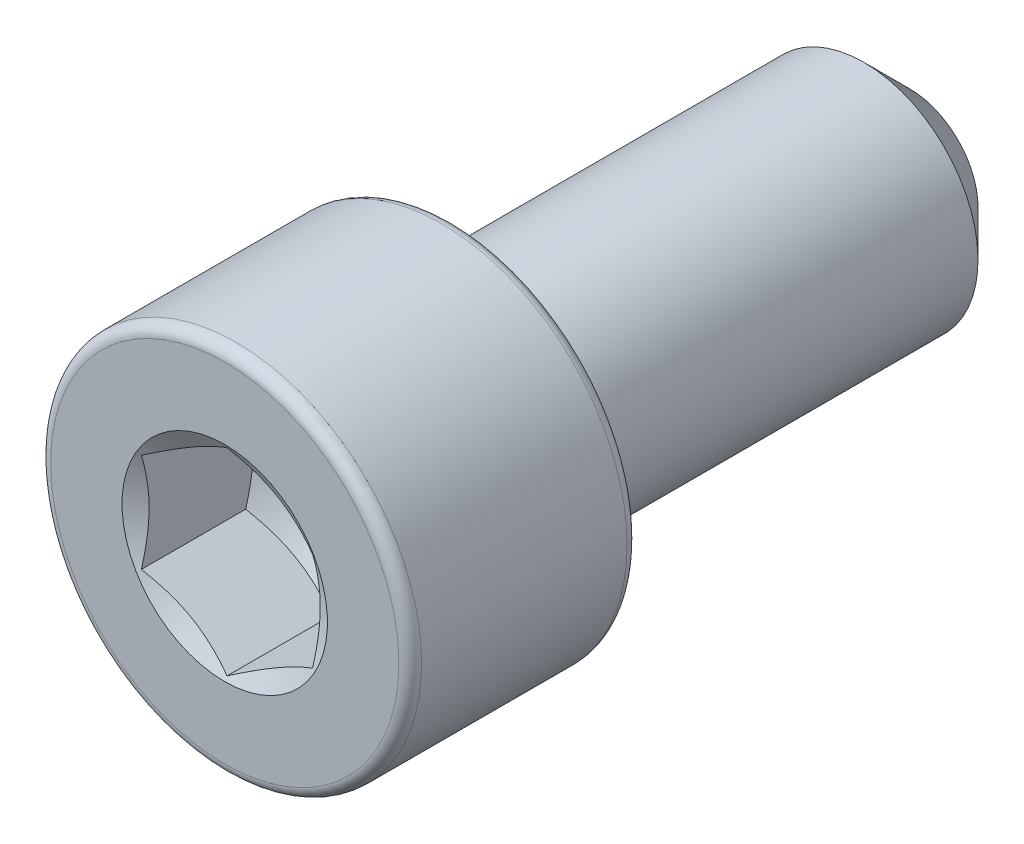
ISO-10303-21;
HEADER;
FILE_DESCRIPTION(('STEP AP214'),'2;1');
FILE_NAME('part.step','',(''),(''),'','','');
FILE_SCHEMA(('AUTOMOTIVE_DESIGN { 1 0 10303 214 1 1 1 1 }'));
ENDSEC;
DATA;
#1=APPLICATION_CONTEXT('core data for automotive mechanical design processes');
#2=APPLICATION_PROTOCOL_DEFINITION('international standard','automotive_design',2000,#1);
#3=PRODUCT_CONTEXT('',#1,'mechanical');
#4=PRODUCT('Part','Part','',(#3));
#5=PRODUCT_RELATED_PRODUCT_CATEGORY('part','',(#4));
#6=PRODUCT_DEFINITION_FORMATION('','',#4);
#7=PRODUCT_DEFINITION_CONTEXT('part definition',#1,'design');
#8=PRODUCT_DEFINITION('design','',#6,#7);
#9=PRODUCT_DEFINITION_SHAPE('','',#8);
#10=(LENGTH_UNIT() NAMED_UNIT(*) SI_UNIT(.MILLI.,.METRE.));
#11=(NAMED_UNIT(*) PLANE_ANGLE_UNIT() SI_UNIT($,.RADIAN.));
#12=(NAMED_UNIT(*) SI_UNIT($,.STERADIAN.) SOLID_ANGLE_UNIT());
#13=UNCERTAINTY_MEASURE_WITH_UNIT(LENGTH_MEASURE(1.E-05),#10,'distance_accuracy_value','');
#14=(GEOMETRIC_REPRESENTATION_CONTEXT(3) GLOBAL_UNCERTAINTY_ASSIGNED_CONTEXT((#13)) GLOBAL_UNIT_ASSIGNED_CONTEXT((#10,
#11,#12)) REPRESENTATION_CONTEXT('',''));
#15=CARTESIAN_POINT('',(0.,0.,0.));
#16=DIRECTION('',(0.,0.,1.));
#17=DIRECTION('',(1.,0.,0.));
#18=AXIS2_PLACEMENT_3D('',#15,#16,#17);
#19=CARTESIAN_POINT('',(0.,0.,8.00000000000001));
#20=DIRECTION('',(0.,0.,1.));
#21=DIRECTION('',(0.,-1.,0.));
#22=AXIS2_PLACEMENT_3D('',#19,#20,#21);
#23=CONICAL_SURFACE('',#22,3.6,1.0471975511966);
#24=CARTESIAN_POINT('',(-0.000200000000000054,-3.4642170851916,7.92160570091724));
#25=CARTESIAN_POINT('',(0.131635206588332,-3.38810199317916,7.87764354293854));
#26=CARTESIAN_POINT('',(0.264608405355249,-3.31132988107607,7.83766142477886));
#27=CARTESIAN_POINT('',(0.532857420002056,-3.15645624025988,7.7678719189317));
#28=CARTESIAN_POINT('',(0.668138002634342,-3.078351959461,7.73808922075161));
#29=CARTESIAN_POINT('',(0.937022602096484,-2.92311136358059,7.69172767769749));
#30=CARTESIAN_POINT('',(1.07058524542946,-2.84599893549862,7.67484027960918));
#31=CARTESIAN_POINT('',(1.33833905729569,-2.6914112001411,7.65467948093476));
#32=CARTESIAN_POINT('',(1.47252925247984,-2.61393645482892,7.65138938626732));
#33=CARTESIAN_POINT('',(1.72327559769581,-2.46916798492017,7.65823036937162));
#34=CARTESIAN_POINT('',(1.83986926497268,-2.40185259973207,7.66668175267885));
#35=CARTESIAN_POINT('',(2.07229698497464,-2.2676603930218,7.69346878149327));
#36=CARTESIAN_POINT('',(2.18813023365133,-2.20078403571721,7.71181357934795));
#37=CARTESIAN_POINT('',(2.42103725705637,-2.06631510305815,7.75767458933956));
#38=CARTESIAN_POINT('',(2.53808155051394,-1.99873954872331,7.78538522374932));
#39=CARTESIAN_POINT('',(2.77042435049913,-1.86459637060759,7.84827763362363));
#40=CARTESIAN_POINT('',(2.88572583417111,-1.79802702797161,7.88344462950779));
#41=CARTESIAN_POINT('',(3.00020000000001,-1.73193533751504,7.92160570091724));
#42=B_SPLINE_CURVE_WITH_KNOTS('',3,(#24,#25,#26,#27,#28,#29,#30,#31,#32,#33,#34,#35,#36,#37,#38,
#39,#40,#41),.UNSPECIFIED.,.F.,.F.,(4,2,2,2,2,2,2,2,4),(0.,0.47553983010304,0.952222784107965,
1.41710776961288,1.88142182298026,2.28572436316091,2.69040156475039,3.10405572063577,
3.51689749407071),.UNSPECIFIED.);
#43=CARTESIAN_POINT('',(0.,-3.46410161513776,7.92153903091736));
#44=VERTEX_POINT('',#43);
#45=CARTESIAN_POINT('',(3.00000000000001,-1.73205080756888,7.92153903091736));
#46=VERTEX_POINT('',#45);
#47=EDGE_CURVE('E187',#44,#46,#42,.T.);
#48=ORIENTED_EDGE('',*,*,#47,.F.);
#49=CARTESIAN_POINT('',(-3.00020000000001,-1.73193533751504,7.92160570091725));
#50=CARTESIAN_POINT('',(-2.86836479341167,-1.80805042952749,7.87764354293854));
#51=CARTESIAN_POINT('',(-2.73539159464476,-1.88482254163057,7.83766142477886));
#52=CARTESIAN_POINT('',(-2.46714257999795,-2.03969618244676,7.7678719189317));
#53=CARTESIAN_POINT('',(-2.33186199736566,-2.11780046324564,7.73808922075161));
#54=CARTESIAN_POINT('',(-2.06297739790352,-2.27304105912605,7.69172767769749));
#55=CARTESIAN_POINT('',(-1.92941475457054,-2.35015348720802,7.67484027960919));
#56=CARTESIAN_POINT('',(-1.66166094270431,-2.50474122256554,7.65467948093476));
#57=CARTESIAN_POINT('',(-1.52747074752016,-2.58221596787772,7.65138938626732));
#58=CARTESIAN_POINT('',(-1.2767244023042,-2.72698443778647,7.65823036937163));
#59=CARTESIAN_POINT('',(-1.16013073502733,-2.79429982297458,7.66668175267885));
#60=CARTESIAN_POINT('',(-0.927703015025365,-2.92849202968484,7.69346878149327));
#61=CARTESIAN_POINT('',(-0.811869766348671,-2.99536838698944,7.71181357934795));
#62=CARTESIAN_POINT('',(-0.578962742943634,-3.12983731964849,7.75767458933956));
#63=CARTESIAN_POINT('',(-0.46191844948606,-3.19741287398333,7.78538522374932));
#64=CARTESIAN_POINT('',(-0.229575649500876,-3.33155605209905,7.84827763362363));
#65=CARTESIAN_POINT('',(-0.114274165828894,-3.39812539473503,7.88344462950779));
#66=CARTESIAN_POINT('',(0.000200000000000271,-3.4642170851916,7.92160570091724));
#67=B_SPLINE_CURVE_WITH_KNOTS('',3,(#49,#50,#51,#52,#53,#54,#55,#56,#57,#58,#59,#60,#61,#62,#63,
#64,#65,#66),.UNSPECIFIED.,.F.,.F.,(4,2,2,2,2,2,2,2,4),(0.,0.475539830103041,0.952222784107965,
1.41710776961288,1.88142182298026,2.28572436316091,2.69040156475039,3.10405572063577,
3.51689749407071),.UNSPECIFIED.);
#68=CARTESIAN_POINT('',(-3.00000000000001,-1.73205080756888,7.92153903091736));
#69=VERTEX_POINT('',#68);
#70=EDGE_CURVE('E188',#69,#44,#67,.T.);
#71=ORIENTED_EDGE('',*,*,#70,.F.);
#72=CARTESIAN_POINT('',(-3.00000000000001,-4.60454559970548,9.0944367695661));
#73=CARTESIAN_POINT('',(-3.00000000000001,-4.47391054169675,9.03126141741228));
#74=CARTESIAN_POINT('',(-3.00000000000001,-4.34297039323752,8.96870586295172));
#75=CARTESIAN_POINT('',(-3.00000000000001,-4.08031748113025,8.84518394102797));
#76=CARTESIAN_POINT('',(-3.00000000000001,-3.9486045951669,8.78421783395116));
#77=CARTESIAN_POINT('',(-3.00000000000001,-3.68354182127473,8.66390732573261));
#78=CARTESIAN_POINT('',(-3.00000000000001,-3.55018689151928,8.6045739931804));
#79=CARTESIAN_POINT('',(-3.00000000000001,-3.28239942855972,8.48840044290758));
#80=CARTESIAN_POINT('',(-3.00000000000001,-3.14796694810594,8.43156010401619));
#81=CARTESIAN_POINT('',(-3.00000000000001,-2.87366017588524,8.31933431950721));
#82=CARTESIAN_POINT('',(-3.00000000000001,-2.7337454902095,8.26404705503255));
#83=CARTESIAN_POINT('',(-3.00000000000001,-2.45226155329319,8.15777424972904));
#84=CARTESIAN_POINT('',(-3.00000000000001,-2.31069211589045,8.10678919831371));
#85=CARTESIAN_POINT('',(-3.00000000000001,-2.02595438104427,8.01049455102487));
#86=CARTESIAN_POINT('',(-3.00000000000001,-1.88279015583218,7.96517303737745));
#87=CARTESIAN_POINT('',(-3.00000000000001,-1.59440901204616,7.88169131765542));
#88=CARTESIAN_POINT('',(-3.00000000000001,-1.44919277107188,7.84352880439202));
#89=CARTESIAN_POINT('',(-3.00000000000001,-1.15742209925239,7.77642805316512));
#90=CARTESIAN_POINT('',(-3.00000000000001,-1.01087896269673,7.74744162313536));
#91=CARTESIAN_POINT('',(-3.00000000000001,-0.716021747589001,7.70036416986872));
#92=CARTESIAN_POINT('',(-3.00000000000001,-0.567707822307367,7.68227221053488));
#93=CARTESIAN_POINT('',(-3.00000000000001,-0.271966241302082,7.65866464300572));
#94=CARTESIAN_POINT('',(-3.00000000000001,-0.124551501985846,7.65299118452597));
#95=CARTESIAN_POINT('',(-3.00000000000001,0.170232897863812,7.6542888917464));
#96=CARTESIAN_POINT('',(-3.00000000000001,0.317602557053719,7.66126040336274));
#97=CARTESIAN_POINT('',(-3.00000000000001,0.569242516646927,7.68347501207321));
#98=CARTESIAN_POINT('',(-3.00000000000001,0.673786797963101,7.69578273353053));
#99=CARTESIAN_POINT('',(-3.00000000000001,0.88207567807701,7.72596864139937));
#100=CARTESIAN_POINT('',(-3.00000000000001,0.985820159978721,7.74384762684388));
#101=CARTESIAN_POINT('',(-3.00000000000001,1.29572170880589,7.8049008124224));
#102=CARTESIAN_POINT('',(-3.00000000000001,1.50042326804649,7.85547892309648));
#103=CARTESIAN_POINT('',(-3.00000000000001,1.90998694990798,7.97218933249931));
#104=CARTESIAN_POINT('',(-3.00000000000001,2.11475617286394,8.0386353280896));
#105=CARTESIAN_POINT('',(-3.00000000000001,2.41907905139384,8.14606638180559));
#106=CARTESIAN_POINT('',(-3.00000000000001,2.52003642794114,8.18316556980637));
#107=CARTESIAN_POINT('',(-3.00000000000001,2.72112426532943,8.25954165870318));
#108=CARTESIAN_POINT('',(-3.00000000000001,2.82125473380418,8.29881853946956));
#109=CARTESIAN_POINT('',(-3.00000000000001,3.04857034792646,8.39037300203019));
#110=CARTESIAN_POINT('',(-3.00000000000001,3.17552349019277,8.44322475633564));
#111=CARTESIAN_POINT('',(-3.00000000000001,3.42842038548634,8.55129565093389));
#112=CARTESIAN_POINT('',(-3.00000000000001,3.55436409186889,8.60651489988548));
#113=CARTESIAN_POINT('',(-3.00000000000001,3.93096455738107,8.77502565888229));
#114=CARTESIAN_POINT('',(-3.00000000000001,4.18035071154589,8.89115373008911));
#115=CARTESIAN_POINT('',(-3.00000000000001,4.67692235862025,9.12852767157089));
#116=CARTESIAN_POINT('',(-3.00000000000001,4.92410570477776,9.24977798728436));
#117=CARTESIAN_POINT('',(-3.00000000000001,5.4167278388721,9.4957836463119));
#118=CARTESIAN_POINT('',(-3.00000000000001,5.66216656911421,9.62053910487207));
#119=CARTESIAN_POINT('',(-3.00000000000001,6.13267205317365,9.86274264739468));
#120=CARTESIAN_POINT('',(-3.00000000000001,6.35783595459021,9.98000263261621));
#121=CARTESIAN_POINT('',(-3.00000000000001,6.80731894508508,10.2161447958732));
#122=CARTESIAN_POINT('',(-3.00000000000001,7.031638009326,10.3350270211332));
#123=CARTESIAN_POINT('',(-3.00000000000001,7.47911775650083,10.5737746366084));
#124=CARTESIAN_POINT('',(-3.00000000000001,7.70227990205747,10.6936372894531));
#125=CARTESIAN_POINT('',(-3.00000000000001,8.14805831498889,10.934347884523));
#126=CARTESIAN_POINT('',(-3.00000000000001,8.37067460852668,11.0551957782749));
#127=CARTESIAN_POINT('',(-3.00000000000001,8.59308735784223,11.1764145555931));
#128=B_SPLINE_CURVE_WITH_KNOTS('',3,(#72,#73,#74,#75,#76,#77,#78,#79,#80,#81,#82,#83,#84,#85,
#86,#87,#88,#89,#90,#91,#92,#93,#94,#95,#96,#97,#98,#99,#100,#101,#102,#103,#104,#105,#106,#107,
#108,#109,#110,#111,#112,#113,#114,#115,#116,#117,#118,#119,#120,#121,#122,#123,#124,#125,#126,
#127),.UNSPECIFIED.,.F.,.F.,(4,2,2,2,2,2,2,2,2,2,2,2,2,2,2,2,2,2,2,2,2,2,2,2,2,2,2,4),(0.,
0.435332783124324,0.87073644080395,1.30859254309794,1.74642733996611,2.19769874753646,
2.64902142207256,3.09937778722197,3.54958876210589,3.99739445311383,4.44516166135399,
4.88720346801788,5.32925736737266,5.64490330832936,5.96059454021016,6.59234794965086,
7.23780982675471,7.56046455676359,7.88311630478916,8.29563090734188,8.70816446301553,
9.53336112987791,10.3592892953865,11.1852446485614,11.9468392934247,12.7084561563303,
13.4683979588476,14.2283025955724),.UNSPECIFIED.);
#129=CARTESIAN_POINT('',(-3.00000000000001,1.73205080756888,7.92153903091736));
#130=VERTEX_POINT('',#129);
#131=EDGE_CURVE('E249',#130,#69,#128,.F.);
#132=ORIENTED_EDGE('',*,*,#131,.F.);
#133=CARTESIAN_POINT('',(0.0002,3.4642170851916,7.92160570091725));
#134=CARTESIAN_POINT('',(-0.131635206588332,3.38810199317915,7.87764354293854));
#135=CARTESIAN_POINT('',(-0.26460840535525,3.31132988107607,7.83766142477886));
#136=CARTESIAN_POINT('',(-0.532857420002056,3.15645624025988,7.7678719189317));
#137=CARTESIAN_POINT('',(-0.668138002634342,3.078351959461,7.73808922075162));
#138=CARTESIAN_POINT('',(-0.937022602096484,2.92311136358059,7.69172767769749));
#139=CARTESIAN_POINT('',(-1.07058524542946,2.84599893549862,7.67484027960919));
#140=CARTESIAN_POINT('',(-1.33833905729569,2.6914112001411,7.65467948093476));
#141=CARTESIAN_POINT('',(-1.47252925247984,2.61393645482892,7.65138938626732));
#142=CARTESIAN_POINT('',(-1.72327559769581,2.46916798492017,7.65823036937163));
#143=CARTESIAN_POINT('',(-1.83986926497268,2.40185259973206,7.66668175267885));
#144=CARTESIAN_POINT('',(-2.07229698497464,2.2676603930218,7.69346878149327));
#145=CARTESIAN_POINT('',(-2.18813023365133,2.2007840357172,7.71181357934795));
#146=CARTESIAN_POINT('',(-2.42103725705637,2.06631510305815,7.75767458933956));
#147=CARTESIAN_POINT('',(-2.53808155051394,1.99873954872331,7.78538522374932));
#148=CARTESIAN_POINT('',(-2.77042435049913,1.86459637060759,7.84827763362363));
#149=CARTESIAN_POINT('',(-2.88572583417111,1.79802702797161,7.88344462950779));
#150=CARTESIAN_POINT('',(-3.00020000000001,1.73193533751504,7.92160570091725));
#151=B_SPLINE_CURVE_WITH_KNOTS('',3,(#133,#134,#135,#136,#137,#138,#139,#140,#141,#142,#143,
#144,#145,#146,#147,#148,#149,#150),.UNSPECIFIED.,.F.,.F.,(4,2,2,2,2,2,2,2,4),(0.,
0.475539830103041,0.952222784107965,1.41710776961288,1.88142182298026,2.28572436316091,
2.69040156475039,3.10405572063577,3.51689749407071),.UNSPECIFIED.);
#152=CARTESIAN_POINT('',(0.,3.46410161513776,7.92153903091736));
#153=VERTEX_POINT('',#152);
#154=EDGE_CURVE('E112',#153,#130,#151,.T.);
#155=ORIENTED_EDGE('',*,*,#154,.F.);
#156=CARTESIAN_POINT('',(3.00020000000001,1.73193533751504,7.92160570091725));
#157=CARTESIAN_POINT('',(2.86836479341167,1.80805042952749,7.87764354293854));
#158=CARTESIAN_POINT('',(2.73539159464476,1.88482254163057,7.83766142477886));
#159=CARTESIAN_POINT('',(2.46714257999795,2.03969618244676,7.7678719189317));
#160=CARTESIAN_POINT('',(2.33186199736566,2.11780046324564,7.73808922075162));
#161=CARTESIAN_POINT('',(2.06297739790352,2.27304105912605,7.69172767769749));
#162=CARTESIAN_POINT('',(1.92941475457054,2.35015348720802,7.67484027960919));
#163=CARTESIAN_POINT('',(1.66166094270431,2.50474122256554,7.65467948093476));
#164=CARTESIAN_POINT('',(1.52747074752016,2.58221596787772,7.65138938626732));
#165=CARTESIAN_POINT('',(1.2767244023042,2.72698443778647,7.65823036937163));
#166=CARTESIAN_POINT('',(1.16013073502733,2.79429982297457,7.66668175267885));
#167=CARTESIAN_POINT('',(0.927703015025365,2.92849202968484,7.69346878149327));
#168=CARTESIAN_POINT('',(0.81186976634867,2.99536838698944,7.71181357934795));
#169=CARTESIAN_POINT('',(0.578962742943633,3.12983731964849,7.75767458933956));
#170=CARTESIAN_POINT('',(0.46191844948606,3.19741287398333,7.78538522374932));
#171=CARTESIAN_POINT('',(0.229575649500876,3.33155605209905,7.84827763362363));
#172=CARTESIAN_POINT('',(0.114274165828894,3.39812539473503,7.88344462950779));
#173=CARTESIAN_POINT('',(-0.000199999999999515,3.4642170851916,7.92160570091725));
#174=B_SPLINE_CURVE_WITH_KNOTS('',3,(#156,#157,#158,#159,#160,#161,#162,#163,#164,#165,#166,
#167,#168,#169,#170,#171,#172,#173),.UNSPECIFIED.,.F.,.F.,(4,2,2,2,2,2,2,2,4),(0.,
0.475539830103041,0.952222784107965,1.41710776961288,1.88142182298026,2.28572436316091,
2.69040156475039,3.10405572063577,3.51689749407071),.UNSPECIFIED.);
#175=CARTESIAN_POINT('',(3.00000000000001,1.73205080756888,7.92153903091736));
#176=VERTEX_POINT('',#175);
#177=EDGE_CURVE('E52',#176,#153,#174,.T.);
#178=ORIENTED_EDGE('',*,*,#177,.F.);
#179=CARTESIAN_POINT('',(3.00000000000001,-4.60454559970548,9.0944367695661));
#180=CARTESIAN_POINT('',(3.00000000000001,-4.47391054169675,9.03126141741228));
#181=CARTESIAN_POINT('',(3.00000000000001,-4.34297039323752,8.96870586295172));
#182=CARTESIAN_POINT('',(3.00000000000001,-4.08031748113025,8.84518394102797));
#183=CARTESIAN_POINT('',(3.00000000000001,-3.9486045951669,8.78421783395116));
#184=CARTESIAN_POINT('',(3.00000000000001,-3.68354182127473,8.66390732573261));
#185=CARTESIAN_POINT('',(3.00000000000001,-3.55018689151928,8.6045739931804));
#186=CARTESIAN_POINT('',(3.00000000000001,-3.28239942855972,8.48840044290758));
#187=CARTESIAN_POINT('',(3.00000000000001,-3.14796694810594,8.43156010401619));
#188=CARTESIAN_POINT('',(3.00000000000001,-2.87366017588524,8.31933431950722));
#189=CARTESIAN_POINT('',(3.00000000000001,-2.7337454902095,8.26404705503255));
#190=CARTESIAN_POINT('',(3.00000000000001,-2.45226155329319,8.15777424972904));
#191=CARTESIAN_POINT('',(3.00000000000001,-2.31069211589045,8.10678919831371));
#192=CARTESIAN_POINT('',(3.00000000000001,-2.02595438104427,8.01049455102487));
#193=CARTESIAN_POINT('',(3.00000000000001,-1.88279015583218,7.96517303737745));
#194=CARTESIAN_POINT('',(3.00000000000001,-1.59440901204616,7.88169131765542));
#195=CARTESIAN_POINT('',(3.00000000000001,-1.44919277107188,7.84352880439202));
#196=CARTESIAN_POINT('',(3.00000000000001,-1.15742209925239,7.77642805316512));
#197=CARTESIAN_POINT('',(3.00000000000001,-1.01087896269673,7.74744162313536));
#198=CARTESIAN_POINT('',(3.00000000000001,-0.716021747589,7.70036416986872));
#199=CARTESIAN_POINT('',(3.00000000000001,-0.567707822307367,7.68227221053488));
#200=CARTESIAN_POINT('',(3.00000000000001,-0.271966241302081,7.65866464300572));
#201=CARTESIAN_POINT('',(3.00000000000001,-0.124551501985845,7.65299118452597));
#202=CARTESIAN_POINT('',(3.00000000000001,0.170232897863813,7.6542888917464));
#203=CARTESIAN_POINT('',(3.00000000000001,0.317602557053719,7.66126040336274));
#204=CARTESIAN_POINT('',(3.00000000000001,0.569242516646928,7.68347501207321));
#205=CARTESIAN_POINT('',(3.00000000000001,0.673786797963102,7.69578273353053));
#206=CARTESIAN_POINT('',(3.00000000000001,0.882075678077011,7.72596864139937));
#207=CARTESIAN_POINT('',(3.00000000000001,0.985820159978722,7.74384762684388));
#208=CARTESIAN_POINT('',(3.00000000000001,1.2957217088059,7.80490081242241));
#209=CARTESIAN_POINT('',(3.00000000000001,1.50042326804649,7.85547892309648));
#210=CARTESIAN_POINT('',(3.00000000000001,1.90998694990798,7.97218933249931));
#211=CARTESIAN_POINT('',(3.00000000000001,2.11475617286394,8.0386353280896));
#212=CARTESIAN_POINT('',(3.00000000000001,2.41907905139385,8.14606638180559));
#213=CARTESIAN_POINT('',(3.00000000000001,2.52003642794114,8.18316556980637));
#214=CARTESIAN_POINT('',(3.00000000000001,2.72112426532943,8.25954165870318));
#215=CARTESIAN_POINT('',(3.00000000000001,2.82125473380418,8.29881853946956));
#216=CARTESIAN_POINT('',(3.00000000000001,3.04857034792646,8.3903730020302));
#217=CARTESIAN_POINT('',(3.00000000000001,3.17552349019277,8.44322475633564));
#218=CARTESIAN_POINT('',(3.00000000000001,3.42842038548634,8.5512956509339));
#219=CARTESIAN_POINT('',(3.00000000000001,3.55436409186889,8.60651489988548));
#220=CARTESIAN_POINT('',(3.00000000000001,3.93096455738107,8.77502565888229));
#221=CARTESIAN_POINT('',(3.00000000000001,4.18035071154589,8.89115373008911));
#222=CARTESIAN_POINT('',(3.00000000000001,4.67692235862025,9.12852767157089));
#223=CARTESIAN_POINT('',(3.00000000000001,4.92410570477776,9.24977798728436));
#224=CARTESIAN_POINT('',(3.00000000000001,5.4167278388721,9.4957836463119));
#225=CARTESIAN_POINT('',(3.00000000000001,5.66216656911421,9.62053910487207));
#226=CARTESIAN_POINT('',(3.00000000000001,6.13267205317366,9.86274264739468));
#227=CARTESIAN_POINT('',(3.00000000000001,6.35783595459021,9.98000263261621));
#228=CARTESIAN_POINT('',(3.00000000000001,6.80731894508508,10.2161447958732));
#229=CARTESIAN_POINT('',(3.00000000000001,7.03163800932601,10.3350270211332));
#230=CARTESIAN_POINT('',(3.00000000000001,7.47911775650084,10.5737746366084));
#231=CARTESIAN_POINT('',(3.00000000000001,7.70227990205748,10.6936372894531));
#232=CARTESIAN_POINT('',(3.00000000000001,8.14805831498889,10.934347884523));
#233=CARTESIAN_POINT('',(3.00000000000001,8.37067460852668,11.0551957782749));
#234=CARTESIAN_POINT('',(3.00000000000001,8.59308735784223,11.1764145555931));
#235=B_SPLINE_CURVE_WITH_KNOTS('',3,(#179,#180,#181,#182,#183,#184,#185,#186,#187,#188,#189,
#190,#191,#192,#193,#194,#195,#196,#197,#198,#199,#200,#201,#202,#203,#204,#205,#206,#207,#208,
#209,#210,#211,#212,#213,#214,#215,#216,#217,#218,#219,#220,#221,#222,#223,#224,#225,#226,#227,
#228,#229,#230,#231,#232,#233,#234),.UNSPECIFIED.,.F.,.F.,(4,2,2,2,2,2,2,2,2,2,2,2,2,2,2,2,2,2,
2,2,2,2,2,2,2,2,2,4),(0.,0.435332783124324,0.87073644080395,1.30859254309794,1.74642733996611,
2.19769874753647,2.64902142207256,3.09937778722197,3.54958876210589,3.99739445311383,
4.44516166135399,4.88720346801788,5.32925736737266,5.64490330832936,5.96059454021016,
6.59234794965086,7.23780982675471,7.56046455676359,7.88311630478917,8.29563090734188,
8.70816446301552,9.5333611298779,10.3592892953865,11.1852446485614,11.9468392934247,
12.7084561563303,13.4683979588476,14.2283025955724),.UNSPECIFIED.);
#236=EDGE_CURVE('E180',#46,#176,#235,.T.);
#237=ORIENTED_EDGE('',*,*,#236,.F.);
#238=EDGE_LOOP('',(#48,#71,#132,#155,#178,#237));
#239=FACE_BOUND('',#238,.T.);
#240=CARTESIAN_POINT('',(0.,0.,8.00000000000001));
#241=DIRECTION('',(0.,0.,-1.));
#242=DIRECTION('',(0.,1.,0.));
#243=AXIS2_PLACEMENT_3D('',#240,#241,#242);
#244=CIRCLE('',#243,3.6);
#245=CARTESIAN_POINT('',(0.,3.6,8.00000000000001));
#246=VERTEX_POINT('',#245);
#247=EDGE_CURVE('E234',#246,#246,#244,.T.);
#248=ORIENTED_EDGE('',*,*,#247,.F.);
#249=EDGE_LOOP('',(#248));
#250=FACE_BOUND('',#249,.T.);
#251=ADVANCED_FACE('F34',(#239,#250),#23,.F.);
#252=CARTESIAN_POINT('',(0.,6.5,8.));
#253=DIRECTION('',(0.,0.,1.));
#254=DIRECTION('',(0.,-1.,0.));
#255=AXIS2_PLACEMENT_3D('',#252,#253,#254);
#256=PLANE('',#255);
#257=CARTESIAN_POINT('',(0.,0.,8.));
#258=DIRECTION('',(0.,0.,1.));
#259=DIRECTION('',(0.,-1.,0.));
#260=AXIS2_PLACEMENT_3D('',#257,#258,#259);
#261=CIRCLE('',#260,6.1);
#262=CARTESIAN_POINT('',(0.,-6.1,8.));
#263=VERTEX_POINT('',#262);
#264=EDGE_CURVE('E42',#263,#263,#261,.T.);
#265=ORIENTED_EDGE('',*,*,#264,.T.);
#266=EDGE_LOOP('',(#265));
#267=FACE_BOUND('',#266,.T.);
#268=ORIENTED_EDGE('',*,*,#247,.T.);
#269=EDGE_LOOP('',(#268));
#270=FACE_BOUND('',#269,.T.);
#271=ADVANCED_FACE('F208',(#267,#270),#256,.T.);
#272=CARTESIAN_POINT('',(0.,0.,-16.));
#273=DIRECTION('',(0.,0.,-1.));
#274=DIRECTION('',(0.,1.,0.));
#275=AXIS2_PLACEMENT_3D('',#272,#273,#274);
#276=CYLINDRICAL_SURFACE('',#275,6.5);
#277=CARTESIAN_POINT('',(0.,0.,7.6));
#278=DIRECTION('',(0.,0.,1.));
#279=DIRECTION('',(0.,-1.,0.));
#280=AXIS2_PLACEMENT_3D('',#277,#278,#279);
#281=CIRCLE('',#280,6.5);
#282=CARTESIAN_POINT('',(0.,-6.5,7.6));
#283=VERTEX_POINT('',#282);
#284=EDGE_CURVE('E203',#283,#283,#281,.F.);
#285=ORIENTED_EDGE('',*,*,#284,.T.);
#286=EDGE_LOOP('',(#285));
#287=FACE_BOUND('',#286,.T.);
#288=CARTESIAN_POINT('',(0.,0.,0.400000000000001));
#289=DIRECTION('',(0.,0.,-1.));
#290=DIRECTION('',(0.,1.,0.));
#291=AXIS2_PLACEMENT_3D('',#288,#289,#290);
#292=CIRCLE('',#291,6.5);
#293=CARTESIAN_POINT('',(0.,6.5,0.400000000000002));
#294=VERTEX_POINT('',#293);
#295=EDGE_CURVE('E200',#294,#294,#292,.F.);
#296=ORIENTED_EDGE('',*,*,#295,.T.);
#297=EDGE_LOOP('',(#296));
#298=FACE_BOUND('',#297,.T.);
#299=ADVANCED_FACE('F215',(#287,#298),#276,.T.);
#300=CARTESIAN_POINT('',(0.,4.6,0.));
#301=DIRECTION('',(0.,0.,-1.));
#302=DIRECTION('',(0.,1.,0.));
#303=AXIS2_PLACEMENT_3D('',#300,#301,#302);
#304=PLANE('',#303);
#305=CARTESIAN_POINT('',(0.,0.,0.));
#306=DIRECTION('',(0.,0.,-1.));
#307=DIRECTION('',(0.,1.,0.));
#308=AXIS2_PLACEMENT_3D('',#305,#306,#307);
#309=CIRCLE('',#308,6.1);
#310=CARTESIAN_POINT('',(0.,6.1,0.));
#311=VERTEX_POINT('',#310);
#312=EDGE_CURVE('E11',#311,#311,#309,.T.);
#313=ORIENTED_EDGE('',*,*,#312,.T.);
#314=EDGE_LOOP('',(#313));
#315=FACE_BOUND('',#314,.T.);
#316=CARTESIAN_POINT('',(0.,0.,0.));
#317=DIRECTION('',(0.,0.,-1.));
#318=DIRECTION('',(0.,1.,0.));
#319=AXIS2_PLACEMENT_3D('',#316,#317,#318);
#320=CIRCLE('',#319,4.6);
#321=CARTESIAN_POINT('',(0.,4.6,0.));
#322=VERTEX_POINT('',#321);
#323=EDGE_CURVE('E232',#322,#322,#320,.T.);
#324=ORIENTED_EDGE('',*,*,#323,.F.);
#325=EDGE_LOOP('',(#324));
#326=FACE_BOUND('',#325,.T.);
#327=ADVANCED_FACE('F218',(#315,#326),#304,.T.);
#328=CARTESIAN_POINT('',(0.,0.,-0.4));
#329=DIRECTION('',(0.,0.,-1.));
#330=DIRECTION('',(0.,1.,0.));
#331=AXIS2_PLACEMENT_3D('',#328,#329,#330);
#332=TOROIDAL_SURFACE('',#331,4.6,0.4);
#333=ORIENTED_EDGE('',*,*,#323,.T.);
#334=EDGE_LOOP('',(#333));
#335=FACE_BOUND('',#334,.T.);
#336=CARTESIAN_POINT('',(0.,0.,-0.277198888030898));
#337=DIRECTION('',(0.,0.,-1.));
#338=DIRECTION('',(0.,1.,0.));
#339=AXIS2_PLACEMENT_3D('',#336,#337,#338);
#340=CIRCLE('',#339,4.21931655289578);
#341=CARTESIAN_POINT('',(0.,4.21931655289578,-0.277198888030898));
#342=VERTEX_POINT('',#341);
#343=EDGE_CURVE('E235',#342,#342,#340,.T.);
#344=ORIENTED_EDGE('',*,*,#343,.F.);
#345=EDGE_LOOP('',(#344));
#346=FACE_BOUND('',#345,.T.);
#347=ADVANCED_FACE('F228',(#335,#346),#332,.F.);
#348=CARTESIAN_POINT('',(0.,0.,-0.897198888030895));
#349=DIRECTION('',(0.,0.,1.));
#350=DIRECTION('',(0.,-1.,0.));
#351=AXIS2_PLACEMENT_3D('',#348,#349,#350);
#352=CONICAL_SURFACE('',#351,4.01931655289578,0.312042121562537);
#353=ORIENTED_EDGE('',*,*,#343,.T.);
#354=EDGE_LOOP('',(#353));
#355=FACE_BOUND('',#354,.T.);
#356=CARTESIAN_POINT('',(0.,0.,-0.897198888030895));
#357=DIRECTION('',(0.,0.,-1.));
#358=DIRECTION('',(0.,1.,0.));
#359=AXIS2_PLACEMENT_3D('',#356,#357,#358);
#360=CIRCLE('',#359,4.01931655289578);
#361=CARTESIAN_POINT('',(0.,4.01931655289578,-0.897198888030895));
#362=VERTEX_POINT('',#361);
#363=EDGE_CURVE('E240',#362,#362,#360,.T.);
#364=ORIENTED_EDGE('',*,*,#363,.F.);
#365=EDGE_LOOP('',(#364));
#366=FACE_BOUND('',#365,.T.);
#367=ADVANCED_FACE('F309',(#355,#366),#352,.T.);
#368=CARTESIAN_POINT('',(0.,0.,-1.02));
#369=DIRECTION('',(0.,0.,-1.));
#370=DIRECTION('',(0.,1.,0.));
#371=AXIS2_PLACEMENT_3D('',#368,#369,#370);
#372=TOROIDAL_SURFACE('',#371,4.4,0.399999999999999);
#373=ORIENTED_EDGE('',*,*,#363,.T.);
#374=EDGE_LOOP('',(#373));
#375=FACE_BOUND('',#374,.T.);
#376=CARTESIAN_POINT('',(0.,0.,-1.02));
#377=DIRECTION('',(0.,0.,-1.));
#378=DIRECTION('',(0.,1.,0.));
#379=AXIS2_PLACEMENT_3D('',#376,#377,#378);
#380=CIRCLE('',#379,4.);
#381=CARTESIAN_POINT('',(0.,4.,-1.02));
#382=VERTEX_POINT('',#381);
#383=EDGE_CURVE('E322',#382,#382,#380,.T.);
#384=ORIENTED_EDGE('',*,*,#383,.F.);
#385=EDGE_LOOP('',(#384));
#386=FACE_BOUND('',#385,.T.);
#387=ADVANCED_FACE('F305',(#375,#386),#372,.F.);
#388=CARTESIAN_POINT('',(0.,0.,-16.));
#389=DIRECTION('',(0.,0.,-1.));
#390=DIRECTION('',(0.,1.,0.));
#391=AXIS2_PLACEMENT_3D('',#388,#389,#390);
#392=CYLINDRICAL_SURFACE('',#391,4.);
#393=ORIENTED_EDGE('',*,*,#383,.T.);
#394=EDGE_LOOP('',(#393));
#395=FACE_BOUND('',#394,.T.);
#396=CARTESIAN_POINT('',(0.,0.,-14.4));
#397=DIRECTION('',(0.,0.,-1.));
#398=DIRECTION('',(0.,1.,0.));
#399=AXIS2_PLACEMENT_3D('',#396,#397,#398);
#400=CIRCLE('',#399,4.);
#401=CARTESIAN_POINT('',(0.,4.,-14.4));
#402=VERTEX_POINT('',#401);
#403=EDGE_CURVE('E324',#402,#402,#400,.T.);
#404=ORIENTED_EDGE('',*,*,#403,.F.);
#405=EDGE_LOOP('',(#404));
#406=FACE_BOUND('',#405,.T.);
#407=ADVANCED_FACE('F301',(#395,#406),#392,.T.);
#408=CARTESIAN_POINT('',(0.,0.,-16.));
#409=DIRECTION('',(0.,0.,1.));
#410=DIRECTION('',(0.,-1.,0.));
#411=AXIS2_PLACEMENT_3D('',#408,#409,#410);
#412=CONICAL_SURFACE('',#411,2.39999999999998,0.785398163397454);
#413=ORIENTED_EDGE('',*,*,#403,.T.);
#414=EDGE_LOOP('',(#413));
#415=FACE_BOUND('',#414,.T.);
#416=CARTESIAN_POINT('',(0.,0.,-16.));
#417=DIRECTION('',(0.,0.,-1.));
#418=DIRECTION('',(0.,1.,0.));
#419=AXIS2_PLACEMENT_3D('',#416,#417,#418);
#420=CIRCLE('',#419,2.39999999999998);
#421=CARTESIAN_POINT('',(0.,2.39999999999998,-16.));
#422=VERTEX_POINT('',#421);
#423=EDGE_CURVE('E98',#422,#422,#420,.T.);
#424=ORIENTED_EDGE('',*,*,#423,.F.);
#425=EDGE_LOOP('',(#424));
#426=FACE_BOUND('',#425,.T.);
#427=ADVANCED_FACE('F293',(#415,#426),#412,.T.);
#428=CARTESIAN_POINT('',(0.,0.,-16.));
#429=DIRECTION('',(0.,0.,-1.));
#430=DIRECTION('',(0.,1.,0.));
#431=AXIS2_PLACEMENT_3D('',#428,#429,#430);
#432=PLANE('',#431);
#433=ORIENTED_EDGE('',*,*,#423,.T.);
#434=EDGE_LOOP('',(#433));
#435=FACE_BOUND('',#434,.T.);
#436=ADVANCED_FACE('F289',(#435),#432,.T.);
#437=CARTESIAN_POINT('',(3.00000000000001,1.73205080756888,-16.001));
#438=DIRECTION('',(0.5,0.866025403784439,0.));
#439=DIRECTION('',(-0.866025403784439,0.5,0.));
#440=AXIS2_PLACEMENT_3D('',#437,#438,#439);
#441=PLANE('',#440);
#442=ORIENTED_EDGE('',*,*,#177,.T.);
#443=DIRECTION('',(0.,0.,1.));
#444=VECTOR('',#443,1.);
#445=CARTESIAN_POINT('',(0.,3.46410161513776,-16.001));
#446=LINE('',#445,#444);
#447=CARTESIAN_POINT('',(0.,3.46410161513776,4.26794919243113));
#448=VERTEX_POINT('',#447);
#449=EDGE_CURVE('E113',#448,#153,#446,.T.);
#450=ORIENTED_EDGE('',*,*,#449,.F.);
#451=CARTESIAN_POINT('',(-0.0002,3.4642170851916,4.26801586243101));
#452=CARTESIAN_POINT('',(0.131635206588332,3.38810199317915,4.22405370445231));
#453=CARTESIAN_POINT('',(0.26460840535525,3.31132988107607,4.18407158629263));
#454=CARTESIAN_POINT('',(0.532857420002057,3.15645624025988,4.11428208044547));
#455=CARTESIAN_POINT('',(0.668138002634343,3.078351959461,4.08449938226538));
#456=CARTESIAN_POINT('',(0.937022602096485,2.92311136358059,4.03813783921126));
#457=CARTESIAN_POINT('',(1.07058524542946,2.84599893549862,4.02125044112295));
#458=CARTESIAN_POINT('',(1.33833905729569,2.6914112001411,4.00108964244853));
#459=CARTESIAN_POINT('',(1.47252925247985,2.61393645482892,3.99779954778108));
#460=CARTESIAN_POINT('',(1.72327559769581,2.46916798492017,4.00464053088539));
#461=CARTESIAN_POINT('',(1.83986926497268,2.40185259973206,4.01309191419262));
#462=CARTESIAN_POINT('',(2.07229698497464,2.2676603930218,4.03987894300704));
#463=CARTESIAN_POINT('',(2.18813023365133,2.2007840357172,4.05822374086172));
#464=CARTESIAN_POINT('',(2.42103725705637,2.06631510305815,4.10408475085333));
#465=CARTESIAN_POINT('',(2.53808155051394,1.99873954872331,4.13179538526308));
#466=CARTESIAN_POINT('',(2.77042435049913,1.86459637060759,4.1946877951374));
#467=CARTESIAN_POINT('',(2.88572583417111,1.79802702797161,4.22985479102156));
#468=CARTESIAN_POINT('',(3.00020000000001,1.73193533751504,4.26801586243101));
#469=B_SPLINE_CURVE_WITH_KNOTS('',3,(#451,#452,#453,#454,#455,#456,#457,#458,#459,#460,#461,
#462,#463,#464,#465,#466,#467,#468),.UNSPECIFIED.,.F.,.F.,(4,2,2,2,2,2,2,2,4),(0.,
0.475539830103042,0.952222784107966,1.41710776961288,1.88142182298026,2.28572436316091,
2.69040156475039,3.10405572063577,3.51689749407071),.UNSPECIFIED.);
#470=CARTESIAN_POINT('',(3.00000000000001,1.73205080756888,4.26794919243113));
#471=VERTEX_POINT('',#470);
#472=EDGE_CURVE('E93',#448,#471,#469,.T.);
#473=ORIENTED_EDGE('',*,*,#472,.T.);
#474=DIRECTION('',(0.,0.,1.));
#475=VECTOR('',#474,1.);
#476=CARTESIAN_POINT('',(3.00000000000001,1.73205080756888,-16.001));
#477=LINE('',#476,#475);
#478=EDGE_CURVE('E109',#471,#176,#477,.T.);
#479=ORIENTED_EDGE('',*,*,#478,.T.);
#480=EDGE_LOOP('',(#442,#450,#473,#479));
#481=FACE_BOUND('',#480,.T.);
#482=ADVANCED_FACE('F175',(#481),#441,.F.);
#483=CARTESIAN_POINT('',(3.00000000000001,-1.73205080756888,-16.001));
#484=DIRECTION('',(1.,0.,0.));
#485=DIRECTION('',(0.,0.,-1.));
#486=AXIS2_PLACEMENT_3D('',#483,#484,#485);
#487=PLANE('',#486);
#488=ORIENTED_EDGE('',*,*,#236,.T.);
#489=ORIENTED_EDGE('',*,*,#478,.F.);
#490=CARTESIAN_POINT('',(3.00000000000001,-4.67276344287529,5.47391853066419));
#491=CARTESIAN_POINT('',(3.00000000000001,-4.54147492619768,5.41015060576887));
#492=CARTESIAN_POINT('',(3.00000000000001,-4.40988701041215,5.3469886306493));
#493=CARTESIAN_POINT('',(3.00000000000001,-4.14595305839837,5.22221728411338));
#494=CARTESIAN_POINT('',(3.00000000000001,-4.01360690807442,5.16060815431675));
#495=CARTESIAN_POINT('',(3.00000000000001,-3.74732607703705,5.03897809843501));
#496=CARTESIAN_POINT('',(3.00000000000001,-3.61338668420164,4.97896745315637));
#497=CARTESIAN_POINT('',(3.00000000000001,-3.34444862427117,4.86137787679204));
#498=CARTESIAN_POINT('',(3.00000000000001,-3.20945000724971,4.80379883156682));
#499=CARTESIAN_POINT('',(3.00000000000001,-2.93392609999458,4.68995731706182));
#500=CARTESIAN_POINT('',(3.00000000000001,-2.79336018469272,4.63379263936042));
#501=CARTESIAN_POINT('',(3.00000000000001,-2.51059186598907,4.5256652456626));
#502=CARTESIAN_POINT('',(3.00000000000001,-2.36838928222324,4.47370299794632));
#503=CARTESIAN_POINT('',(3.00000000000001,-2.0823801102572,4.37532836011376));
#504=CARTESIAN_POINT('',(3.00000000000001,-1.93857734740635,4.32890495901644));
#505=CARTESIAN_POINT('',(3.00000000000001,-1.64891025852194,4.24308341969876));
#506=CARTESIAN_POINT('',(3.00000000000001,-1.50304659027436,4.20368309222946));
#507=CARTESIAN_POINT('',(3.00000000000001,-1.20989864945308,4.13397239487861));
#508=CARTESIAN_POINT('',(3.00000000000001,-1.06262520580664,4.10361732103464));
#509=CARTESIAN_POINT('',(3.00000000000001,-0.766227952476693,4.0537312271657));
#510=CARTESIAN_POINT('',(3.00000000000001,-0.617104355184775,4.0341989762579));
#511=CARTESIAN_POINT('',(3.00000000000001,-0.31969966669032,4.00777020377239));
#512=CARTESIAN_POINT('',(3.00000000000001,-0.171433475549809,4.00071014571749));
#513=CARTESIAN_POINT('',(3.00000000000001,0.125174265112125,3.99939280951997));
#514=CARTESIAN_POINT('',(3.00000000000001,0.273515818232519,4.00513621455485));
#515=CARTESIAN_POINT('',(3.00000000000001,0.524611677027345,4.02528675464401));
#516=CARTESIAN_POINT('',(3.00000000000001,0.62763310434365,4.03656166370521));
#517=CARTESIAN_POINT('',(3.00000000000001,0.832933277446971,4.06459754178793));
#518=CARTESIAN_POINT('',(3.00000000000001,0.93521191256066,4.08135931185895));
#519=CARTESIAN_POINT('',(3.00000000000001,1.24081828336191,4.1390020993523));
#520=CARTESIAN_POINT('',(3.00000000000001,1.442776624229,4.1872278733702));
#521=CARTESIAN_POINT('',(3.00000000000001,1.74506887648518,4.27104540597817));
#522=CARTESIAN_POINT('',(3.00000000000001,1.84696047466049,4.3013395799787));
#523=CARTESIAN_POINT('',(3.00000000000001,2.04969161662668,4.36509135783365));
#524=CARTESIAN_POINT('',(3.00000000000001,2.15053174786706,4.39854707714361));
#525=CARTESIAN_POINT('',(3.00000000000001,2.35128029791001,4.46810611859037));
#526=CARTESIAN_POINT('',(3.00000000000001,2.45118876498884,4.50420930267394));
#527=CARTESIAN_POINT('',(3.00000000000001,2.65019024030627,4.57863192883377));
#528=CARTESIAN_POINT('',(3.00000000000001,2.74928313362135,4.61695167734191));
#529=CARTESIAN_POINT('',(3.00000000000001,2.96480343388038,4.70262071543466));
#530=CARTESIAN_POINT('',(3.00000000000001,3.08108383059752,4.7503389351319));
#531=CARTESIAN_POINT('',(3.00000000000001,3.31276064747994,4.84787931356128));
#532=CARTESIAN_POINT('',(3.00000000000001,3.42815703091107,4.89770155916955));
#533=CARTESIAN_POINT('',(3.00000000000001,3.77325354980208,5.04974840620611));
#534=CARTESIAN_POINT('',(3.00000000000001,4.00182297344293,5.15453767400527));
#535=CARTESIAN_POINT('',(3.00000000000001,4.45687408585372,5.36883530479534));
#536=CARTESIAN_POINT('',(3.00000000000001,4.68335453106528,5.47834628301134));
#537=CARTESIAN_POINT('',(3.00000000000001,5.13468375957501,5.70069081471853));
#538=CARTESIAN_POINT('',(3.00000000000001,5.35953248761729,5.81352448007963));
#539=CARTESIAN_POINT('',(3.00000000000001,5.80851444671138,6.04187462389105));
#540=CARTESIAN_POINT('',(3.00000000000001,6.03264482040001,6.15739670339741));
#541=CARTESIAN_POINT('',(3.00000000000001,6.47995800776311,6.39026864298501));
#542=CARTESIAN_POINT('',(3.00000000000001,6.70314080248585,6.50761853940578));
#543=CARTESIAN_POINT('',(3.00000000000001,7.37142136813053,6.86164815969661));
#544=CARTESIAN_POINT('',(3.00000000000001,7.81542265151068,7.10039587897806));
#545=CARTESIAN_POINT('',(3.00000000000001,8.63669853454591,7.54608610355987));
#546=CARTESIAN_POINT('',(3.00000000000001,9.0142246810193,7.75256723304632));
#547=CARTESIAN_POINT('',(3.00000000000001,9.76835016802318,8.16731285053311));
#548=CARTESIAN_POINT('',(3.00000000000001,10.1449494018653,8.37557753249985));
#549=CARTESIAN_POINT('',(3.00000000000001,10.8958481793085,8.79249093268716));
#550=CARTESIAN_POINT('',(3.00000000000001,11.2701507060177,9.00113428516894));
#551=CARTESIAN_POINT('',(3.00000000000001,12.0181718613676,9.4193594957152));
#552=CARTESIAN_POINT('',(3.00000000000001,12.3918905551102,9.62894123730551));
#553=CARTESIAN_POINT('',(3.00000000000001,12.7654203955407,9.83885750154184));
#554=B_SPLINE_CURVE_WITH_KNOTS('',3,(#490,#491,#492,#493,#494,#495,#496,#497,#498,#499,#500,
#501,#502,#503,#504,#505,#506,#507,#508,#509,#510,#511,#512,#513,#514,#515,#516,#517,#518,#519,
#520,#521,#522,#523,#524,#525,#526,#527,#528,#529,#530,#531,#532,#533,#534,#535,#536,#537,#538,
#539,#540,#541,#542,#543,#544,#545,#546,#547,#548,#549,#550,#551,#552,#553),.UNSPECIFIED.,.F.,
.F.,(4,2,2,2,2,2,2,2,2,2,2,2,2,2,2,2,2,2,2,2,2,2,2,2,2,2,2,2,2,2,2,4),(0.,0.437871921560237,
0.875811559714996,1.31609817044344,1.756364091053,2.21042581848894,2.66453807287454,
3.11773197486736,3.57078435819753,4.02155901682897,4.47228239819763,4.91705072141861,
5.36184277751454,5.67260254811402,5.98340770806482,6.6054374288067,6.92430888857323,
7.24299145912839,7.56165742363987,7.88036754832936,8.25741347939495,8.63447499409709,
9.38872124553041,10.1433907589427,10.8980857100647,11.6545260491744,12.4109814466071,
13.9233143737346,15.2142183900454,16.5052646252016,17.7908408329938,19.0762616677323),.UNSPECIFIED.);
#555=CARTESIAN_POINT('',(3.00000000000001,-1.73205080756888,4.26794919243112));
#556=VERTEX_POINT('',#555);
#557=EDGE_CURVE('E160',#471,#556,#554,.F.);
#558=ORIENTED_EDGE('',*,*,#557,.T.);
#559=DIRECTION('',(0.,0.,1.));
#560=VECTOR('',#559,1.);
#561=CARTESIAN_POINT('',(3.00000000000001,-1.73205080756888,-16.001));
#562=LINE('',#561,#560);
#563=EDGE_CURVE('E283',#556,#46,#562,.T.);
#564=ORIENTED_EDGE('',*,*,#563,.T.);
#565=EDGE_LOOP('',(#488,#489,#558,#564));
#566=FACE_BOUND('',#565,.T.);
#567=ADVANCED_FACE('F171',(#566),#487,.F.);
#568=CARTESIAN_POINT('',(0.,-3.46410161513776,-16.001));
#569=DIRECTION('',(0.5,-0.866025403784439,0.));
#570=DIRECTION('',(0.866025403784439,0.5,0.));
#571=AXIS2_PLACEMENT_3D('',#568,#569,#570);
#572=PLANE('',#571);
#573=ORIENTED_EDGE('',*,*,#47,.T.);
#574=ORIENTED_EDGE('',*,*,#563,.F.);
#575=CARTESIAN_POINT('',(3.00020000000001,-1.73193533751504,4.26801586243101));
#576=CARTESIAN_POINT('',(2.86836479341167,-1.80805042952749,4.22405370445231));
#577=CARTESIAN_POINT('',(2.73539159464476,-1.88482254163057,4.18407158629263));
#578=CARTESIAN_POINT('',(2.46714257999795,-2.03969618244676,4.11428208044547));
#579=CARTESIAN_POINT('',(2.33186199736566,-2.11780046324564,4.08449938226538));
#580=CARTESIAN_POINT('',(2.06297739790352,-2.27304105912605,4.03813783921126));
#581=CARTESIAN_POINT('',(1.92941475457054,-2.35015348720802,4.02125044112295));
#582=CARTESIAN_POINT('',(1.66166094270431,-2.50474122256554,4.00108964244852));
#583=CARTESIAN_POINT('',(1.52747074752016,-2.58221596787772,3.99779954778108));
#584=CARTESIAN_POINT('',(1.2767244023042,-2.72698443778647,4.00464053088539));
#585=CARTESIAN_POINT('',(1.16013073502733,-2.79429982297458,4.01309191419262));
#586=CARTESIAN_POINT('',(0.927703015025366,-2.92849202968484,4.03987894300704));
#587=CARTESIAN_POINT('',(0.811869766348671,-2.99536838698944,4.05822374086171));
#588=CARTESIAN_POINT('',(0.578962742943634,-3.12983731964849,4.10408475085333));
#589=CARTESIAN_POINT('',(0.461918449486061,-3.19741287398333,4.13179538526308));
#590=CARTESIAN_POINT('',(0.229575649500876,-3.33155605209905,4.1946877951374));
#591=CARTESIAN_POINT('',(0.114274165828894,-3.39812539473503,4.22985479102156));
#592=CARTESIAN_POINT('',(-0.000200000000000182,-3.4642170851916,4.26801586243101));
#593=B_SPLINE_CURVE_WITH_KNOTS('',3,(#575,#576,#577,#578,#579,#580,#581,#582,#583,#584,#585,
#586,#587,#588,#589,#590,#591,#592),.UNSPECIFIED.,.F.,.F.,(4,2,2,2,2,2,2,2,4),(0.,
0.475539830103041,0.952222784107965,1.41710776961288,1.88142182298026,2.28572436316091,
2.69040156475039,3.10405572063577,3.51689749407071),.UNSPECIFIED.);
#594=CARTESIAN_POINT('',(0.,-3.46410161513776,4.26794919243112));
#595=VERTEX_POINT('',#594);
#596=EDGE_CURVE('E153',#556,#595,#593,.T.);
#597=ORIENTED_EDGE('',*,*,#596,.T.);
#598=DIRECTION('',(0.,0.,1.));
#599=VECTOR('',#598,1.);
#600=CARTESIAN_POINT('',(0.,-3.46410161513776,-16.001));
#601=LINE('',#600,#599);
#602=EDGE_CURVE('E115',#595,#44,#601,.T.);
#603=ORIENTED_EDGE('',*,*,#602,.T.);
#604=EDGE_LOOP('',(#573,#574,#597,#603));
#605=FACE_BOUND('',#604,.T.);
#606=ADVANCED_FACE('F174',(#605),#572,.F.);
#607=CARTESIAN_POINT('',(-3.00000000000001,-1.73205080756888,-16.001));
#608=DIRECTION('',(-0.5,-0.866025403784439,0.));
#609=DIRECTION('',(0.866025403784439,-0.5,0.));
#610=AXIS2_PLACEMENT_3D('',#607,#608,#609);
#611=PLANE('',#610);
#612=ORIENTED_EDGE('',*,*,#70,.T.);
#613=ORIENTED_EDGE('',*,*,#602,.F.);
#614=CARTESIAN_POINT('',(0.000200000000000014,-3.4642170851916,4.26801586243101));
#615=CARTESIAN_POINT('',(-0.131635206588332,-3.38810199317916,4.22405370445231));
#616=CARTESIAN_POINT('',(-0.26460840535525,-3.31132988107607,4.18407158629263));
#617=CARTESIAN_POINT('',(-0.532857420002056,-3.15645624025988,4.11428208044547));
#618=CARTESIAN_POINT('',(-0.668138002634343,-3.078351959461,4.08449938226538));
#619=CARTESIAN_POINT('',(-0.937022602096484,-2.92311136358059,4.03813783921126));
#620=CARTESIAN_POINT('',(-1.07058524542946,-2.84599893549862,4.02125044112295));
#621=CARTESIAN_POINT('',(-1.33833905729569,-2.6914112001411,4.00108964244852));
#622=CARTESIAN_POINT('',(-1.47252925247984,-2.61393645482892,3.99779954778108));
#623=CARTESIAN_POINT('',(-1.72327559769581,-2.46916798492017,4.00464053088539));
#624=CARTESIAN_POINT('',(-1.83986926497268,-2.40185259973207,4.01309191419262));
#625=CARTESIAN_POINT('',(-2.07229698497464,-2.2676603930218,4.03987894300704));
#626=CARTESIAN_POINT('',(-2.18813023365133,-2.2007840357172,4.05822374086171));
#627=CARTESIAN_POINT('',(-2.42103725705637,-2.06631510305815,4.10408475085333));
#628=CARTESIAN_POINT('',(-2.53808155051394,-1.99873954872331,4.13179538526308));
#629=CARTESIAN_POINT('',(-2.77042435049913,-1.8645963706076,4.1946877951374));
#630=CARTESIAN_POINT('',(-2.88572583417111,-1.79802702797161,4.22985479102156));
#631=CARTESIAN_POINT('',(-3.00020000000001,-1.73193533751504,4.26801586243101));
#632=B_SPLINE_CURVE_WITH_KNOTS('',3,(#614,#615,#616,#617,#618,#619,#620,#621,#622,#623,#624,
#625,#626,#627,#628,#629,#630,#631),.UNSPECIFIED.,.F.,.F.,(4,2,2,2,2,2,2,2,4),(0.,
0.475539830103041,0.952222784107965,1.41710776961288,1.88142182298026,2.28572436316091,
2.69040156475039,3.10405572063577,3.51689749407071),.UNSPECIFIED.);
#633=CARTESIAN_POINT('',(-3.00000000000001,-1.73205080756922,4.2679491924309));
#634=VERTEX_POINT('',#633);
#635=EDGE_CURVE('E108',#595,#634,#632,.T.);
#636=ORIENTED_EDGE('',*,*,#635,.T.);
#637=DIRECTION('',(0.,0.,1.));
#638=VECTOR('',#637,1.);
#639=CARTESIAN_POINT('',(-3.00000000000001,-1.73205080756888,-16.001));
#640=LINE('',#639,#638);
#641=EDGE_CURVE('E107',#634,#69,#640,.T.);
#642=ORIENTED_EDGE('',*,*,#641,.T.);
#643=EDGE_LOOP('',(#612,#613,#636,#642));
#644=FACE_BOUND('',#643,.T.);
#645=ADVANCED_FACE('F260',(#644),#611,.F.);
#646=CARTESIAN_POINT('',(-3.00000000000001,1.73205080756888,-16.001));
#647=DIRECTION('',(-1.,0.,0.));
#648=DIRECTION('',(0.,0.,1.));
#649=AXIS2_PLACEMENT_3D('',#646,#647,#648);
#650=PLANE('',#649);
#651=ORIENTED_EDGE('',*,*,#131,.T.);
#652=ORIENTED_EDGE('',*,*,#641,.F.);
#653=CARTESIAN_POINT('',(-3.00000000000001,-4.67276344287529,5.47391853066419));
#654=CARTESIAN_POINT('',(-3.00000000000001,-4.54147492619768,5.41015060576887));
#655=CARTESIAN_POINT('',(-3.00000000000001,-4.40988701041215,5.3469886306493));
#656=CARTESIAN_POINT('',(-3.00000000000001,-4.14595305839837,5.22221728411338));
#657=CARTESIAN_POINT('',(-3.00000000000001,-4.01360690807442,5.16060815431675));
#658=CARTESIAN_POINT('',(-3.00000000000001,-3.74732607703705,5.03897809843501));
#659=CARTESIAN_POINT('',(-3.00000000000001,-3.61338668420164,4.97896745315637));
#660=CARTESIAN_POINT('',(-3.00000000000001,-3.34444862427117,4.86137787679205));
#661=CARTESIAN_POINT('',(-3.00000000000001,-3.20945000724972,4.80379883156682));
#662=CARTESIAN_POINT('',(-3.00000000000001,-2.93392609999459,4.68995731706182));
#663=CARTESIAN_POINT('',(-3.00000000000001,-2.79336018469272,4.63379263936043));
#664=CARTESIAN_POINT('',(-3.00000000000001,-2.51059186598908,4.5256652456626));
#665=CARTESIAN_POINT('',(-3.00000000000001,-2.36838928222324,4.47370299794632));
#666=CARTESIAN_POINT('',(-3.00000000000001,-2.0823801102572,4.37532836011376));
#667=CARTESIAN_POINT('',(-3.00000000000001,-1.93857734740635,4.32890495901644));
#668=CARTESIAN_POINT('',(-3.00000000000001,-1.64891025852194,4.24308341969876));
#669=CARTESIAN_POINT('',(-3.00000000000001,-1.50304659027436,4.20368309222946));
#670=CARTESIAN_POINT('',(-3.00000000000001,-1.20989864945308,4.13397239487861));
#671=CARTESIAN_POINT('',(-3.00000000000001,-1.06262520580664,4.10361732103464));
#672=CARTESIAN_POINT('',(-3.00000000000001,-0.766227952476693,4.0537312271657));
#673=CARTESIAN_POINT('',(-3.00000000000001,-0.617104355184776,4.0341989762579));
#674=CARTESIAN_POINT('',(-3.00000000000001,-0.31969966669032,4.00777020377239));
#675=CARTESIAN_POINT('',(-3.00000000000001,-0.17143347554981,4.00071014571749));
#676=CARTESIAN_POINT('',(-3.00000000000001,0.125174265112124,3.99939280951997));
#677=CARTESIAN_POINT('',(-3.00000000000001,0.273515818232518,4.00513621455485));
#678=CARTESIAN_POINT('',(-3.00000000000001,0.524611677027344,4.02528675464401));
#679=CARTESIAN_POINT('',(-3.00000000000001,0.627633104343649,4.03656166370521));
#680=CARTESIAN_POINT('',(-3.00000000000001,0.832933277446969,4.06459754178793));
#681=CARTESIAN_POINT('',(-3.00000000000001,0.935211912560659,4.08135931185895));
#682=CARTESIAN_POINT('',(-3.00000000000001,1.24081828336191,4.1390020993523));
#683=CARTESIAN_POINT('',(-3.00000000000001,1.442776624229,4.1872278733702));
#684=CARTESIAN_POINT('',(-3.00000000000001,1.74506887648517,4.27104540597817));
#685=CARTESIAN_POINT('',(-3.00000000000001,1.84696047466048,4.3013395799787));
#686=CARTESIAN_POINT('',(-3.00000000000001,2.04969161662668,4.36509135783365));
#687=CARTESIAN_POINT('',(-3.00000000000001,2.15053174786705,4.39854707714361));
#688=CARTESIAN_POINT('',(-3.00000000000001,2.35128029791001,4.46810611859037));
#689=CARTESIAN_POINT('',(-3.00000000000001,2.45118876498884,4.50420930267394));
#690=CARTESIAN_POINT('',(-3.00000000000001,2.65019024030627,4.57863192883377));
#691=CARTESIAN_POINT('',(-3.00000000000001,2.74928313362135,4.61695167734191));
#692=CARTESIAN_POINT('',(-3.00000000000001,2.96480343388038,4.70262071543466));
#693=CARTESIAN_POINT('',(-3.00000000000001,3.08108383059752,4.7503389351319));
#694=CARTESIAN_POINT('',(-3.00000000000001,3.31276064747994,4.84787931356128));
#695=CARTESIAN_POINT('',(-3.00000000000001,3.42815703091107,4.89770155916955));
#696=CARTESIAN_POINT('',(-3.00000000000001,3.77325354980208,5.04974840620611));
#697=CARTESIAN_POINT('',(-3.00000000000001,4.00182297344293,5.15453767400527));
#698=CARTESIAN_POINT('',(-3.00000000000001,4.45687408585372,5.36883530479534));
#699=CARTESIAN_POINT('',(-3.00000000000001,4.68335453106528,5.47834628301134));
#700=CARTESIAN_POINT('',(-3.00000000000001,5.13468375957502,5.70069081471854));
#701=CARTESIAN_POINT('',(-3.00000000000001,5.3595324876173,5.81352448007964));
#702=CARTESIAN_POINT('',(-3.00000000000001,5.80851444671138,6.04187462389105));
#703=CARTESIAN_POINT('',(-3.00000000000001,6.03264482040002,6.15739670339741));
#704=CARTESIAN_POINT('',(-3.00000000000001,6.47995800776312,6.39026864298502));
#705=CARTESIAN_POINT('',(-3.00000000000001,6.70314080248585,6.50761853940579));
#706=CARTESIAN_POINT('',(-3.00000000000001,7.37142136813053,6.86164815969662));
#707=CARTESIAN_POINT('',(-3.00000000000001,7.81542265151069,7.10039587897806));
#708=CARTESIAN_POINT('',(-3.00000000000001,8.63669853454592,7.54608610355987));
#709=CARTESIAN_POINT('',(-3.00000000000001,9.0142246810193,7.75256723304632));
#710=CARTESIAN_POINT('',(-3.00000000000001,9.76835016802318,8.16731285053311));
#711=CARTESIAN_POINT('',(-3.00000000000001,10.1449494018653,8.37557753249985));
#712=CARTESIAN_POINT('',(-3.00000000000001,10.8958481793085,8.79249093268715));
#713=CARTESIAN_POINT('',(-3.00000000000001,11.2701507060177,9.00113428516893));
#714=CARTESIAN_POINT('',(-3.00000000000001,12.0181718613676,9.4193594957152));
#715=CARTESIAN_POINT('',(-3.00000000000001,12.3918905551102,9.62894123730551));
#716=CARTESIAN_POINT('',(-3.00000000000001,12.7654203955407,9.83885750154183));
#717=B_SPLINE_CURVE_WITH_KNOTS('',3,(#653,#654,#655,#656,#657,#658,#659,#660,#661,#662,#663,
#664,#665,#666,#667,#668,#669,#670,#671,#672,#673,#674,#675,#676,#677,#678,#679,#680,#681,#682,
#683,#684,#685,#686,#687,#688,#689,#690,#691,#692,#693,#694,#695,#696,#697,#698,#699,#700,#701,
#702,#703,#704,#705,#706,#707,#708,#709,#710,#711,#712,#713,#714,#715,#716),.UNSPECIFIED.,.F.,
.F.,(4,2,2,2,2,2,2,2,2,2,2,2,2,2,2,2,2,2,2,2,2,2,2,2,2,2,2,2,2,2,2,4),(0.,0.437871921560235,
0.875811559714994,1.31609817044344,1.75636409105299,2.21042581848893,2.66453807287454,
3.11773197486736,3.57078435819753,4.02155901682897,4.47228239819763,4.91705072141861,
5.36184277751454,5.67260254811401,5.98340770806482,6.60543742880669,6.92430888857323,
7.24299145912839,7.56165742363987,7.88036754832936,8.25741347939495,8.63447499409709,
9.38872124553042,10.1433907589427,10.8980857100647,11.6545260491744,12.4109814466071,
13.9233143737347,15.2142183900454,16.5052646252016,17.7908408329938,19.0762616677323),.UNSPECIFIED.);
#718=CARTESIAN_POINT('',(-3.00000000000001,1.73205080756888,4.26794919243112));
#719=VERTEX_POINT('',#718);
#720=EDGE_CURVE('E90',#634,#719,#717,.T.);
#721=ORIENTED_EDGE('',*,*,#720,.T.);
#722=DIRECTION('',(0.,0.,1.));
#723=VECTOR('',#722,1.);
#724=CARTESIAN_POINT('',(-3.00000000000001,1.73205080756888,-16.001));
#725=LINE('',#724,#723);
#726=EDGE_CURVE('E104',#719,#130,#725,.T.);
#727=ORIENTED_EDGE('',*,*,#726,.T.);
#728=EDGE_LOOP('',(#651,#652,#721,#727));
#729=FACE_BOUND('',#728,.T.);
#730=ADVANCED_FACE('F103',(#729),#650,.F.);
#731=CARTESIAN_POINT('',(0.,3.46410161513776,-16.001));
#732=DIRECTION('',(-0.5,0.866025403784439,0.));
#733=DIRECTION('',(-0.866025403784439,-0.5,0.));
#734=AXIS2_PLACEMENT_3D('',#731,#732,#733);
#735=PLANE('',#734);
#736=ORIENTED_EDGE('',*,*,#154,.T.);
#737=ORIENTED_EDGE('',*,*,#726,.F.);
#738=CARTESIAN_POINT('',(-3.00020000000001,1.73193533751504,4.26801586243101));
#739=CARTESIAN_POINT('',(-2.86836479341167,1.80805042952748,4.22405370445231));
#740=CARTESIAN_POINT('',(-2.73539159464476,1.88482254163057,4.18407158629263));
#741=CARTESIAN_POINT('',(-2.46714257999795,2.03969618244675,4.11428208044547));
#742=CARTESIAN_POINT('',(-2.33186199736566,2.11780046324564,4.08449938226538));
#743=CARTESIAN_POINT('',(-2.06297739790352,2.27304105912605,4.03813783921126));
#744=CARTESIAN_POINT('',(-1.92941475457054,2.35015348720802,4.02125044112295));
#745=CARTESIAN_POINT('',(-1.66166094270431,2.50474122256554,4.00108964244853));
#746=CARTESIAN_POINT('',(-1.52747074752016,2.58221596787772,3.99779954778108));
#747=CARTESIAN_POINT('',(-1.2767244023042,2.72698443778647,4.00464053088539));
#748=CARTESIAN_POINT('',(-1.16013073502733,2.79429982297457,4.01309191419262));
#749=CARTESIAN_POINT('',(-0.927703015025366,2.92849202968484,4.03987894300704));
#750=CARTESIAN_POINT('',(-0.811869766348671,2.99536838698944,4.05822374086172));
#751=CARTESIAN_POINT('',(-0.578962742943634,3.12983731964849,4.10408475085333));
#752=CARTESIAN_POINT('',(-0.46191844948606,3.19741287398333,4.13179538526309));
#753=CARTESIAN_POINT('',(-0.229575649500876,3.33155605209905,4.1946877951374));
#754=CARTESIAN_POINT('',(-0.114274165828894,3.39812539473503,4.22985479102156));
#755=CARTESIAN_POINT('',(0.000200000000000387,3.4642170851916,4.26801586243101));
#756=B_SPLINE_CURVE_WITH_KNOTS('',3,(#738,#739,#740,#741,#742,#743,#744,#745,#746,#747,#748,
#749,#750,#751,#752,#753,#754,#755),.UNSPECIFIED.,.F.,.F.,(4,2,2,2,2,2,2,2,4),(0.,
0.475539830103042,0.952222784107966,1.41710776961288,1.88142182298026,2.28572436316091,
2.69040156475039,3.10405572063577,3.51689749407071),.UNSPECIFIED.);
#757=EDGE_CURVE('E86',#719,#448,#756,.T.);
#758=ORIENTED_EDGE('',*,*,#757,.T.);
#759=ORIENTED_EDGE('',*,*,#449,.T.);
#760=EDGE_LOOP('',(#736,#737,#758,#759));
#761=FACE_BOUND('',#760,.T.);
#762=ADVANCED_FACE('F111',(#761),#735,.F.);
#763=CARTESIAN_POINT('',(0.,0.,4.));
#764=DIRECTION('',(0.,0.,1.));
#765=DIRECTION('',(0.,-1.,0.));
#766=AXIS2_PLACEMENT_3D('',#763,#764,#765);
#767=CONICAL_SURFACE('',#766,3.,1.0471975511966);
#768=CARTESIAN_POINT('',(0.,0.,2.26794919243113));
#769=VERTEX_POINT('',#768);
#770=VERTEX_LOOP('',#769);
#771=FACE_BOUND('',#770,.T.);
#772=ORIENTED_EDGE('',*,*,#635,.F.);
#773=ORIENTED_EDGE('',*,*,#596,.F.);
#774=ORIENTED_EDGE('',*,*,#557,.F.);
#775=ORIENTED_EDGE('',*,*,#472,.F.);
#776=ORIENTED_EDGE('',*,*,#757,.F.);
#777=ORIENTED_EDGE('',*,*,#720,.F.);
#778=EDGE_LOOP('',(#772,#773,#774,#775,#776,#777));
#779=FACE_BOUND('',#778,.T.);
#780=ADVANCED_FACE('F89',(#771,#779),#767,.F.);
#781=CARTESIAN_POINT('',(0.,0.,7.6));
#782=DIRECTION('',(0.,0.,1.));
#783=DIRECTION('',(0.,-1.,0.));
#784=AXIS2_PLACEMENT_3D('',#781,#782,#783);
#785=TOROIDAL_SURFACE('',#784,6.1,0.4);
#786=ORIENTED_EDGE('',*,*,#264,.F.);
#787=EDGE_LOOP('',(#786));
#788=FACE_BOUND('',#787,.T.);
#789=ORIENTED_EDGE('',*,*,#284,.F.);
#790=EDGE_LOOP('',(#789));
#791=FACE_BOUND('',#790,.T.);
#792=ADVANCED_FACE('F133',(#788,#791),#785,.T.);
#793=CARTESIAN_POINT('',(0.,0.,0.400000000000001));
#794=DIRECTION('',(0.,0.,-1.));
#795=DIRECTION('',(0.,1.,0.));
#796=AXIS2_PLACEMENT_3D('',#793,#794,#795);
#797=TOROIDAL_SURFACE('',#796,6.1,0.4);
#798=ORIENTED_EDGE('',*,*,#295,.F.);
#799=EDGE_LOOP('',(#798));
#800=FACE_BOUND('',#799,.T.);
#801=ORIENTED_EDGE('',*,*,#312,.F.);
#802=EDGE_LOOP('',(#801));
#803=FACE_BOUND('',#802,.T.);
#804=ADVANCED_FACE('F36',(#800,#803),#797,.T.);
#805=CLOSED_SHELL('',(#251,#271,#299,#327,#347,#367,#387,#407,#427,#436,#482,#567,#606,#645,
#730,#762,#780,#792,#804));
#806=MANIFOLD_SOLID_BREP('B2',#805);
#807=ADVANCED_BREP_SHAPE_REPRESENTATION('',(#18,#806),#14);
#808=SHAPE_DEFINITION_REPRESENTATION(#9,#807);
ENDSEC;
END-ISO-10303-21;
